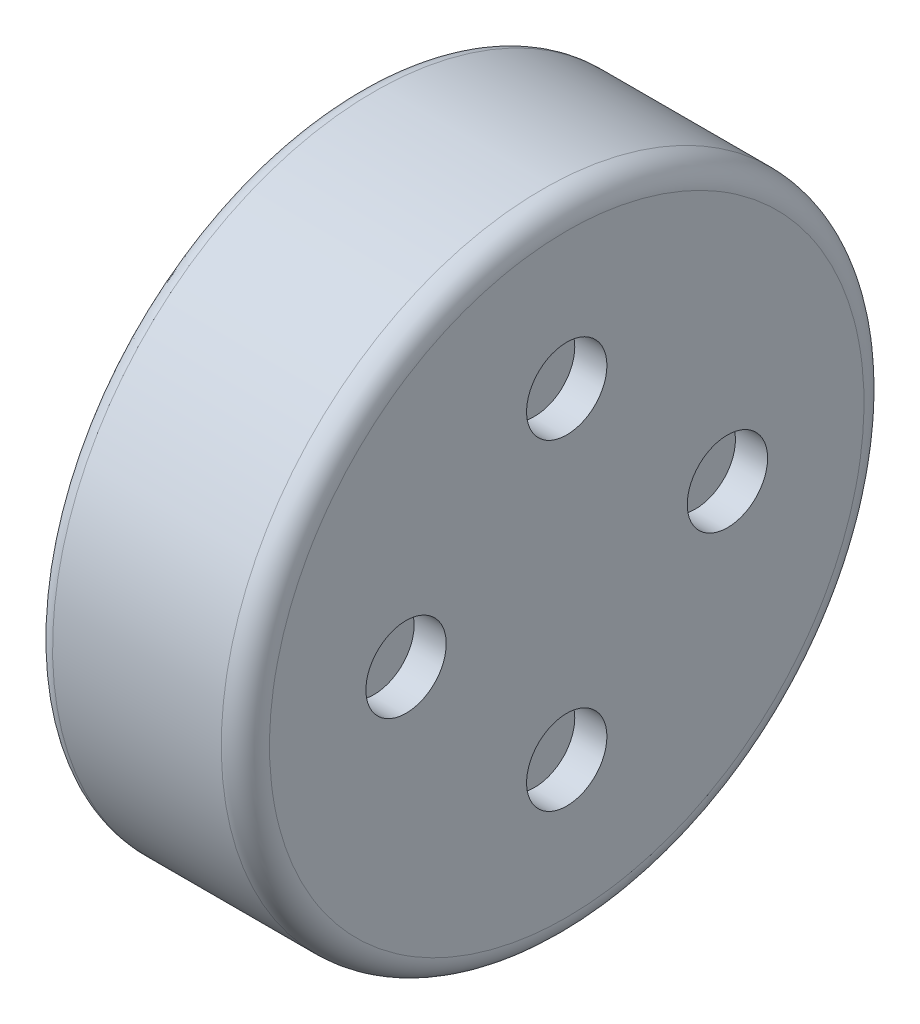
ISO-10303-21;
HEADER;
FILE_DESCRIPTION(('STEP AP214'),'2;1');
FILE_NAME('part.step','',(''),(''),'','','');
FILE_SCHEMA(('AUTOMOTIVE_DESIGN { 1 0 10303 214 1 1 1 1 }'));
ENDSEC;
DATA;
#1=APPLICATION_CONTEXT('core data for automotive mechanical design processes');
#2=APPLICATION_PROTOCOL_DEFINITION('international standard','automotive_design',2000,#1);
#3=PRODUCT_CONTEXT('',#1,'mechanical');
#4=PRODUCT('Part','Part','',(#3));
#5=PRODUCT_RELATED_PRODUCT_CATEGORY('part','',(#4));
#6=PRODUCT_DEFINITION_FORMATION('','',#4);
#7=PRODUCT_DEFINITION_CONTEXT('part definition',#1,'design');
#8=PRODUCT_DEFINITION('design','',#6,#7);
#9=PRODUCT_DEFINITION_SHAPE('','',#8);
#10=(LENGTH_UNIT() NAMED_UNIT(*) SI_UNIT(.MILLI.,.METRE.));
#11=(NAMED_UNIT(*) PLANE_ANGLE_UNIT() SI_UNIT($,.RADIAN.));
#12=(NAMED_UNIT(*) SI_UNIT($,.STERADIAN.) SOLID_ANGLE_UNIT());
#13=UNCERTAINTY_MEASURE_WITH_UNIT(LENGTH_MEASURE(1.E-05),#10,'distance_accuracy_value','');
#14=(GEOMETRIC_REPRESENTATION_CONTEXT(3) GLOBAL_UNCERTAINTY_ASSIGNED_CONTEXT((#13)) GLOBAL_UNIT_ASSIGNED_CONTEXT((#10,
#11,#12)) REPRESENTATION_CONTEXT('',''));
#15=CARTESIAN_POINT('',(0.,0.,0.));
#16=DIRECTION('',(0.,0.,1.));
#17=DIRECTION('',(1.,0.,0.));
#18=AXIS2_PLACEMENT_3D('',#15,#16,#17);
#19=CARTESIAN_POINT('',(0.,1.976,1.977361278997));
#20=DIRECTION('',(1.,0.,0.));
#21=DIRECTION('',(0.,-1.,0.));
#22=AXIS2_PLACEMENT_3D('',#19,#20,#21);
#23=PLANE('',#22);
#24=CARTESIAN_POINT('',(0.,0.,0.));
#25=DIRECTION('',(-1.,0.,0.));
#26=DIRECTION('',(0.,0.,1.));
#27=AXIS2_PLACEMENT_3D('',#24,#25,#26);
#28=CIRCLE('',#27,1.84999999999992);
#29=CARTESIAN_POINT('',(0.,0.,1.84999999999992));
#30=VERTEX_POINT('',#29);
#31=EDGE_CURVE('E12',#30,#30,#28,.T.);
#32=ORIENTED_EDGE('',*,*,#31,.F.);
#33=EDGE_LOOP('',(#32));
#34=FACE_BOUND('',#33,.T.);
#35=CARTESIAN_POINT('',(0.,0.,0.));
#36=DIRECTION('',(1.,0.,0.));
#37=DIRECTION('',(0.,0.,-1.));
#38=AXIS2_PLACEMENT_3D('',#35,#36,#37);
#39=CIRCLE('',#38,1.89999999999975);
#40=CARTESIAN_POINT('',(0.,0.,-1.89999999999978));
#41=VERTEX_POINT('',#40);
#42=EDGE_CURVE('E24',#41,#41,#39,.T.);
#43=ORIENTED_EDGE('',*,*,#42,.F.);
#44=EDGE_LOOP('',(#43));
#45=FACE_BOUND('',#44,.T.);
#46=ADVANCED_FACE('F20',(#34,#45),#23,.F.);
#47=CARTESIAN_POINT('',(0.0499999999999991,0.,0.));
#48=DIRECTION('',(-1.,0.,0.));
#49=DIRECTION('',(0.,0.,1.));
#50=AXIS2_PLACEMENT_3D('',#47,#48,#49);
#51=TOROIDAL_SURFACE('',#50,1.84999999999987,0.0499999999999997);
#52=ORIENTED_EDGE('',*,*,#31,.T.);
#53=EDGE_LOOP('',(#52));
#54=FACE_BOUND('',#53,.T.);
#55=CARTESIAN_POINT('',(0.0500000000000243,0.,0.));
#56=DIRECTION('',(-1.,0.,0.));
#57=DIRECTION('',(0.,0.999975195076289,-0.00704338215194111));
#58=AXIS2_PLACEMENT_3D('',#55,#56,#57);
#59=CIRCLE('',#58,1.79999999999987);
#60=CARTESIAN_POINT('',(0.0500000000000243,1.79995535113719,-0.0126780878734931));
#61=VERTEX_POINT('',#60);
#62=EDGE_CURVE('E105',#61,#61,#59,.T.);
#63=ORIENTED_EDGE('',*,*,#62,.F.);
#64=EDGE_LOOP('',(#63));
#65=FACE_BOUND('',#64,.T.);
#66=ADVANCED_FACE('F237',(#54,#65),#51,.T.);
#67=CARTESIAN_POINT('',(0.0999999999999999,0.,0.));
#68=DIRECTION('',(1.,0.,0.));
#69=DIRECTION('',(0.,0.,-1.));
#70=AXIS2_PLACEMENT_3D('',#67,#68,#69);
#71=TOROIDAL_SURFACE('',#70,1.89999999999958,0.0999999999999999);
#72=CARTESIAN_POINT('',(0.10000000000003,0.,0.));
#73=DIRECTION('',(1.,0.,0.));
#74=DIRECTION('',(0.,-0.999979907996012,-0.00633905389532759));
#75=AXIS2_PLACEMENT_3D('',#72,#73,#74);
#76=CIRCLE('',#75,1.99999999999958);
#77=CARTESIAN_POINT('',(0.10000000000003,-1.9999598159916,-0.0126781077906525));
#78=VERTEX_POINT('',#77);
#79=EDGE_CURVE('E110',#78,#78,#76,.T.);
#80=ORIENTED_EDGE('',*,*,#79,.F.);
#81=EDGE_LOOP('',(#80));
#82=FACE_BOUND('',#81,.T.);
#83=ORIENTED_EDGE('',*,*,#42,.T.);
#84=EDGE_LOOP('',(#83));
#85=FACE_BOUND('',#84,.T.);
#86=ADVANCED_FACE('F242',(#82,#85),#71,.T.);
#87=CARTESIAN_POINT('',(0.0499999999999999,0.,0.));
#88=DIRECTION('',(-1.,0.,0.));
#89=DIRECTION('',(0.,0.,1.));
#90=AXIS2_PLACEMENT_3D('',#87,#88,#89);
#91=CYLINDRICAL_SURFACE('',#90,1.8);
#92=CARTESIAN_POINT('',(0.0300000000000001,0.,0.));
#93=DIRECTION('',(-1.,0.,0.));
#94=DIRECTION('',(0.,0.,1.));
#95=AXIS2_PLACEMENT_3D('',#92,#93,#94);
#96=CIRCLE('',#95,1.8);
#97=CARTESIAN_POINT('',(0.0300000000000001,0.,1.8));
#98=VERTEX_POINT('',#97);
#99=EDGE_CURVE('E116',#98,#98,#96,.T.);
#100=ORIENTED_EDGE('',*,*,#99,.F.);
#101=EDGE_LOOP('',(#100));
#102=FACE_BOUND('',#101,.T.);
#103=ORIENTED_EDGE('',*,*,#62,.T.);
#104=EDGE_LOOP('',(#103));
#105=FACE_BOUND('',#104,.T.);
#106=ADVANCED_FACE('F248',(#102,#105),#91,.T.);
#107=CARTESIAN_POINT('',(0.100000000000001,0.,0.));
#108=DIRECTION('',(1.,0.,0.));
#109=DIRECTION('',(0.,0.,-1.));
#110=AXIS2_PLACEMENT_3D('',#107,#108,#109);
#111=CYLINDRICAL_SURFACE('',#110,2.);
#112=CARTESIAN_POINT('',(1.14999999999997,0.,0.));
#113=DIRECTION('',(1.,0.,0.));
#114=DIRECTION('',(0.,-1.,0.));
#115=AXIS2_PLACEMENT_3D('',#112,#113,#114);
#116=CIRCLE('',#115,2.);
#117=CARTESIAN_POINT('',(1.14999999999997,-2.,0.));
#118=VERTEX_POINT('',#117);
#119=EDGE_CURVE('E158',#118,#118,#116,.T.);
#120=ORIENTED_EDGE('',*,*,#119,.F.);
#121=EDGE_LOOP('',(#120));
#122=FACE_BOUND('',#121,.T.);
#123=ORIENTED_EDGE('',*,*,#79,.T.);
#124=EDGE_LOOP('',(#123));
#125=FACE_BOUND('',#124,.T.);
#126=ADVANCED_FACE('F251',(#122,#125),#111,.T.);
#127=CARTESIAN_POINT('',(0.03,1.872,-1.872));
#128=DIRECTION('',(-1.,0.,0.));
#129=DIRECTION('',(0.,-1.,0.));
#130=AXIS2_PLACEMENT_3D('',#127,#128,#129);
#131=PLANE('',#130);
#132=CARTESIAN_POINT('',(0.0300000000000007,-1.093714993739,-0.3553695435312));
#133=DIRECTION('',(1.,0.,0.));
#134=DIRECTION('',(0.,0.,1.));
#135=AXIS2_PLACEMENT_3D('',#132,#133,#134);
#136=CIRCLE('',#135,0.1999999999996);
#137=CARTESIAN_POINT('',(0.0300000000000007,-1.093714993739,-0.1553695435316));
#138=VERTEX_POINT('',#137);
#139=EDGE_CURVE('E115',#138,#138,#136,.T.);
#140=ORIENTED_EDGE('',*,*,#139,.T.);
#141=EDGE_LOOP('',(#140));
#142=FACE_BOUND('',#141,.T.);
#143=CARTESIAN_POINT('',(0.0300000000000007,-0.6759530401363,0.9303695435312));
#144=DIRECTION('',(1.,0.,0.));
#145=DIRECTION('',(0.,0.,1.));
#146=AXIS2_PLACEMENT_3D('',#143,#144,#145);
#147=CIRCLE('',#146,0.2);
#148=CARTESIAN_POINT('',(0.0300000000000007,-0.6759530401363,1.1303695435312));
#149=VERTEX_POINT('',#148);
#150=EDGE_CURVE('E793',#149,#149,#147,.T.);
#151=ORIENTED_EDGE('',*,*,#150,.T.);
#152=EDGE_LOOP('',(#151));
#153=FACE_BOUND('',#152,.T.);
#154=CARTESIAN_POINT('',(0.0300000000000007,0.6759530401363,0.9303695435312));
#155=DIRECTION('',(1.,0.,0.));
#156=DIRECTION('',(0.,0.,1.));
#157=AXIS2_PLACEMENT_3D('',#154,#155,#156);
#158=CIRCLE('',#157,0.2);
#159=CARTESIAN_POINT('',(0.0300000000000007,0.6759530401363,1.1303695435312));
#160=VERTEX_POINT('',#159);
#161=EDGE_CURVE('E797',#160,#160,#158,.T.);
#162=ORIENTED_EDGE('',*,*,#161,.T.);
#163=EDGE_LOOP('',(#162));
#164=FACE_BOUND('',#163,.T.);
#165=CARTESIAN_POINT('',(0.0300000000000007,1.093714993739,-0.3553695435312));
#166=DIRECTION('',(1.,0.,0.));
#167=DIRECTION('',(0.,0.,1.));
#168=AXIS2_PLACEMENT_3D('',#165,#166,#167);
#169=CIRCLE('',#168,0.2);
#170=CARTESIAN_POINT('',(0.0300000000000007,1.093714993739,-0.1553695435312));
#171=VERTEX_POINT('',#170);
#172=EDGE_CURVE('E801',#171,#171,#169,.T.);
#173=ORIENTED_EDGE('',*,*,#172,.T.);
#174=EDGE_LOOP('',(#173));
#175=FACE_BOUND('',#174,.T.);
#176=CARTESIAN_POINT('',(0.0300000000000007,0.,-1.15));
#177=DIRECTION('',(1.,0.,0.));
#178=DIRECTION('',(0.,0.,1.));
#179=AXIS2_PLACEMENT_3D('',#176,#177,#178);
#180=CIRCLE('',#179,0.2);
#181=CARTESIAN_POINT('',(0.0300000000000007,0.,-0.95));
#182=VERTEX_POINT('',#181);
#183=EDGE_CURVE('E805',#182,#182,#180,.T.);
#184=ORIENTED_EDGE('',*,*,#183,.T.);
#185=EDGE_LOOP('',(#184));
#186=FACE_BOUND('',#185,.T.);
#187=CARTESIAN_POINT('',(0.0300000000000012,0.,0.));
#188=DIRECTION('',(1.,0.,0.));
#189=DIRECTION('',(0.,0.,1.));
#190=AXIS2_PLACEMENT_3D('',#187,#188,#189);
#191=CIRCLE('',#190,0.9);
#192=CARTESIAN_POINT('',(0.0300000000000012,0.,0.9));
#193=VERTEX_POINT('',#192);
#194=EDGE_CURVE('E809',#193,#193,#191,.T.);
#195=ORIENTED_EDGE('',*,*,#194,.T.);
#196=EDGE_LOOP('',(#195));
#197=FACE_BOUND('',#196,.T.);
#198=ORIENTED_EDGE('',*,*,#99,.T.);
#199=EDGE_LOOP('',(#198));
#200=FACE_BOUND('',#199,.T.);
#201=ADVANCED_FACE('F255',(#142,#153,#164,#175,#186,#197,#200),#131,.T.);
#202=CARTESIAN_POINT('',(1.15,0.,0.));
#203=DIRECTION('',(1.,0.,0.));
#204=DIRECTION('',(0.,0.,-1.));
#205=AXIS2_PLACEMENT_3D('',#202,#203,#204);
#206=TOROIDAL_SURFACE('',#205,1.84999999999961,0.15);
#207=ORIENTED_EDGE('',*,*,#119,.T.);
#208=EDGE_LOOP('',(#207));
#209=FACE_BOUND('',#208,.T.);
#210=CARTESIAN_POINT('',(1.3,-1.84999999999977,3.95252000616812E-13));
#211=CARTESIAN_POINT('',(1.3,-1.84999999999962,-0.242574683896374));
#212=CARTESIAN_POINT('',(1.3,-1.80180116790839,-0.484161985174389));
#213=CARTESIAN_POINT('',(1.3,-1.61655310238297,-0.931766714575433));
#214=CARTESIAN_POINT('',(1.3,-1.4793664503779,-1.13682680389755));
#215=CARTESIAN_POINT('',(1.3,-1.13692864001234,-1.47946828649159));
#216=CARTESIAN_POINT('',(1.3,-0.931711601267875,-1.61642004708754));
#217=CARTESIAN_POINT('',(1.3,-0.484217098483389,-1.80193422320322));
#218=CARTESIAN_POINT('',(1.3,-0.242212106851741,-1.84992799099265));
#219=CARTESIAN_POINT('',(1.3,0.24221210685096,-1.85007200900659));
#220=CARTESIAN_POINT('',(1.3,0.484161985174186,-1.80180116790846));
#221=CARTESIAN_POINT('',(1.3,0.931766714575635,-1.61655310238291));
#222=CARTESIAN_POINT('',(1.3,1.13682680389726,-1.47936645037829));
#223=CARTESIAN_POINT('',(1.3,1.47946828649188,-1.13692864001196));
#224=CARTESIAN_POINT('',(1.3,1.61642004708769,-0.931711601267392));
#225=CARTESIAN_POINT('',(1.3,1.80193422320308,-0.484217098483871));
#226=CARTESIAN_POINT('',(1.3,1.84999999999962,-0.24331513264727));
#227=CARTESIAN_POINT('',(1.3,1.84999999999977,-2.34269662046164E-13));
#228=B_SPLINE_CURVE_WITH_KNOTS('',3,(#210,#211,#212,#213,#214,#215,#216,#217,#218,#219,#220,
#221,#222,#223,#224,#225,#226,#227),.UNSPECIFIED.,.F.,.F.,(4,2,2,2,2,2,2,2,4),(0.,0.125,0.25,
0.375,0.5,0.625,0.75,0.875,1.),.UNSPECIFIED.);
#229=CARTESIAN_POINT('',(1.3,-1.84999999999977,3.95252000616812E-13));
#230=VERTEX_POINT('',#229);
#231=CARTESIAN_POINT('',(1.3,1.84999999999977,-2.34269662046164E-13));
#232=VERTEX_POINT('',#231);
#233=EDGE_CURVE('E38',#230,#232,#228,.T.);
#234=ORIENTED_EDGE('',*,*,#233,.F.);
#235=CARTESIAN_POINT('',(1.3,1.84999999999977,-2.34269662046164E-13));
#236=CARTESIAN_POINT('',(1.3,1.84999999999962,0.242574683896181));
#237=CARTESIAN_POINT('',(1.3,1.80180116790838,0.484161985174327));
#238=CARTESIAN_POINT('',(1.3,1.61655310238302,0.931766714575401));
#239=CARTESIAN_POINT('',(1.3,1.47936645037807,1.13682680389738));
#240=CARTESIAN_POINT('',(1.3,1.13692864001232,1.47946828649161));
#241=CARTESIAN_POINT('',(1.3,0.931711601268343,1.61642004708741));
#242=CARTESIAN_POINT('',(1.3,0.4842170984832,1.80193422320324));
#243=CARTESIAN_POINT('',(1.3,0.242212106851824,1.8499279909927));
#244=CARTESIAN_POINT('',(1.3,-0.24221210685064,1.85007200900654));
#245=CARTESIAN_POINT('',(1.3,-0.484161985175012,1.8018011679081));
#246=CARTESIAN_POINT('',(1.3,-0.931766714574344,1.61655310238345));
#247=CARTESIAN_POINT('',(1.3,-1.13682680389705,1.47936645037849));
#248=CARTESIAN_POINT('',(1.3,-1.47946828649166,1.13692864001218));
#249=CARTESIAN_POINT('',(1.3,-1.61642004708728,0.931711601268595));
#250=CARTESIAN_POINT('',(1.3,-1.80193422320321,0.48421709848332));
#251=CARTESIAN_POINT('',(1.3,-1.84999999999962,0.243315132647136));
#252=CARTESIAN_POINT('',(1.3,-1.84999999999977,3.95252000616812E-13));
#253=B_SPLINE_CURVE_WITH_KNOTS('',3,(#235,#236,#237,#238,#239,#240,#241,#242,#243,#244,#245,
#246,#247,#248,#249,#250,#251,#252),.UNSPECIFIED.,.F.,.F.,(4,2,2,2,2,2,2,2,4),(0.,0.125,0.25,
0.375,0.5,0.625,0.75,0.875,1.),.UNSPECIFIED.);
#254=EDGE_CURVE('E129',#232,#230,#253,.T.);
#255=ORIENTED_EDGE('',*,*,#254,.F.);
#256=EDGE_LOOP('',(#234,#255));
#257=FACE_BOUND('',#256,.T.);
#258=ADVANCED_FACE('F259',(#209,#257),#206,.T.);
#259=CARTESIAN_POINT('',(0.0300000000000007,-1.093714993739,-0.3553695435312));
#260=DIRECTION('',(-1.,0.,0.));
#261=DIRECTION('',(0.,0.,1.));
#262=AXIS2_PLACEMENT_3D('',#259,#260,#261);
#263=CYLINDRICAL_SURFACE('',#262,0.1999999999996);
#264=ORIENTED_EDGE('',*,*,#139,.F.);
#265=EDGE_LOOP('',(#264));
#266=FACE_BOUND('',#265,.T.);
#267=CARTESIAN_POINT('',(0.0199999999999993,-1.093714993739,-0.3553695435312));
#268=DIRECTION('',(-1.,0.,0.));
#269=DIRECTION('',(0.,1.,0.));
#270=AXIS2_PLACEMENT_3D('',#267,#268,#269);
#271=CIRCLE('',#270,0.1999999999996);
#272=CARTESIAN_POINT('',(0.0199999999999993,-0.8937149937394,-0.3553695435312));
#273=VERTEX_POINT('',#272);
#274=EDGE_CURVE('E123',#273,#273,#271,.T.);
#275=ORIENTED_EDGE('',*,*,#274,.F.);
#276=EDGE_LOOP('',(#275));
#277=FACE_BOUND('',#276,.T.);
#278=ADVANCED_FACE('F261',(#266,#277),#263,.T.);
#279=CARTESIAN_POINT('',(0.0300000000000007,-0.6759530401363,0.9303695435312));
#280=DIRECTION('',(-1.,0.,0.));
#281=DIRECTION('',(0.,0.,1.));
#282=AXIS2_PLACEMENT_3D('',#279,#280,#281);
#283=CYLINDRICAL_SURFACE('',#282,0.2);
#284=ORIENTED_EDGE('',*,*,#150,.F.);
#285=EDGE_LOOP('',(#284));
#286=FACE_BOUND('',#285,.T.);
#287=CARTESIAN_POINT('',(0.0199999999999993,-0.6759530401363,0.9303695435312));
#288=DIRECTION('',(-1.,0.,0.));
#289=DIRECTION('',(0.,1.,0.));
#290=AXIS2_PLACEMENT_3D('',#287,#288,#289);
#291=CIRCLE('',#290,0.2);
#292=CARTESIAN_POINT('',(0.0199999999999993,-0.4759530401363,0.9303695435312));
#293=VERTEX_POINT('',#292);
#294=EDGE_CURVE('E128',#293,#293,#291,.T.);
#295=ORIENTED_EDGE('',*,*,#294,.F.);
#296=EDGE_LOOP('',(#295));
#297=FACE_BOUND('',#296,.T.);
#298=ADVANCED_FACE('F264',(#286,#297),#283,.T.);
#299=CARTESIAN_POINT('',(0.0300000000000007,0.6759530401363,0.9303695435312));
#300=DIRECTION('',(-1.,0.,0.));
#301=DIRECTION('',(0.,0.,1.));
#302=AXIS2_PLACEMENT_3D('',#299,#300,#301);
#303=CYLINDRICAL_SURFACE('',#302,0.2);
#304=ORIENTED_EDGE('',*,*,#161,.F.);
#305=EDGE_LOOP('',(#304));
#306=FACE_BOUND('',#305,.T.);
#307=CARTESIAN_POINT('',(0.0199999999999993,0.6759530401363,0.9303695435312));
#308=DIRECTION('',(-1.,0.,0.));
#309=DIRECTION('',(0.,1.,0.));
#310=AXIS2_PLACEMENT_3D('',#307,#308,#309);
#311=CIRCLE('',#310,0.2);
#312=CARTESIAN_POINT('',(0.0199999999999993,0.8759530401363,0.9303695435312));
#313=VERTEX_POINT('',#312);
#314=EDGE_CURVE('E138',#313,#313,#311,.T.);
#315=ORIENTED_EDGE('',*,*,#314,.F.);
#316=EDGE_LOOP('',(#315));
#317=FACE_BOUND('',#316,.T.);
#318=ADVANCED_FACE('F268',(#306,#317),#303,.T.);
#319=CARTESIAN_POINT('',(0.0300000000000007,1.093714993739,-0.3553695435312));
#320=DIRECTION('',(-1.,0.,0.));
#321=DIRECTION('',(0.,0.,1.));
#322=AXIS2_PLACEMENT_3D('',#319,#320,#321);
#323=CYLINDRICAL_SURFACE('',#322,0.2);
#324=ORIENTED_EDGE('',*,*,#172,.F.);
#325=EDGE_LOOP('',(#324));
#326=FACE_BOUND('',#325,.T.);
#327=CARTESIAN_POINT('',(0.0199999999999993,1.093714993739,-0.3553695435312));
#328=DIRECTION('',(-1.,0.,0.));
#329=DIRECTION('',(0.,1.,0.));
#330=AXIS2_PLACEMENT_3D('',#327,#328,#329);
#331=CIRCLE('',#330,0.2);
#332=CARTESIAN_POINT('',(0.0199999999999993,1.293714993739,-0.3553695435312));
#333=VERTEX_POINT('',#332);
#334=EDGE_CURVE('E143',#333,#333,#331,.T.);
#335=ORIENTED_EDGE('',*,*,#334,.F.);
#336=EDGE_LOOP('',(#335));
#337=FACE_BOUND('',#336,.T.);
#338=ADVANCED_FACE('F272',(#326,#337),#323,.T.);
#339=CARTESIAN_POINT('',(0.0300000000000007,0.,-1.15));
#340=DIRECTION('',(-1.,0.,0.));
#341=DIRECTION('',(0.,0.,1.));
#342=AXIS2_PLACEMENT_3D('',#339,#340,#341);
#343=CYLINDRICAL_SURFACE('',#342,0.2);
#344=ORIENTED_EDGE('',*,*,#183,.F.);
#345=EDGE_LOOP('',(#344));
#346=FACE_BOUND('',#345,.T.);
#347=CARTESIAN_POINT('',(0.0199999999999993,0.,-1.15));
#348=DIRECTION('',(-1.,0.,0.));
#349=DIRECTION('',(0.,1.,0.));
#350=AXIS2_PLACEMENT_3D('',#347,#348,#349);
#351=CIRCLE('',#350,0.2);
#352=CARTESIAN_POINT('',(0.0199999999999993,0.2,-1.15));
#353=VERTEX_POINT('',#352);
#354=EDGE_CURVE('E147',#353,#353,#351,.T.);
#355=ORIENTED_EDGE('',*,*,#354,.F.);
#356=EDGE_LOOP('',(#355));
#357=FACE_BOUND('',#356,.T.);
#358=ADVANCED_FACE('F276',(#346,#357),#343,.T.);
#359=CARTESIAN_POINT('',(0.0799999999999988,0.,0.));
#360=DIRECTION('',(-1.,0.,0.));
#361=DIRECTION('',(0.,0.,1.));
#362=AXIS2_PLACEMENT_3D('',#359,#360,#361);
#363=CYLINDRICAL_SURFACE('',#362,0.9);
#364=ORIENTED_EDGE('',*,*,#194,.F.);
#365=EDGE_LOOP('',(#364));
#366=FACE_BOUND('',#365,.T.);
#367=CARTESIAN_POINT('',(0.0799999999999988,0.,0.));
#368=DIRECTION('',(1.,0.,0.));
#369=DIRECTION('',(0.,0.,1.));
#370=AXIS2_PLACEMENT_3D('',#367,#368,#369);
#371=CIRCLE('',#370,0.9);
#372=CARTESIAN_POINT('',(0.0799999999999988,0.,0.9));
#373=VERTEX_POINT('',#372);
#374=EDGE_CURVE('E153',#373,#373,#371,.T.);
#375=ORIENTED_EDGE('',*,*,#374,.T.);
#376=EDGE_LOOP('',(#375));
#377=FACE_BOUND('',#376,.T.);
#378=ADVANCED_FACE('F280',(#366,#377),#363,.F.);
#379=CARTESIAN_POINT('',(1.3,1.924,1.925325451786));
#380=DIRECTION('',(1.,0.,0.));
#381=DIRECTION('',(0.,-1.,0.));
#382=AXIS2_PLACEMENT_3D('',#379,#380,#381);
#383=PLANE('',#382);
#384=CARTESIAN_POINT('',(1.29999999999993,0.,1.));
#385=DIRECTION('',(-1.,0.,0.));
#386=DIRECTION('',(0.,0.,-1.));
#387=AXIS2_PLACEMENT_3D('',#384,#385,#386);
#388=CIRCLE('',#387,0.25);
#389=CARTESIAN_POINT('',(1.29999999999993,0.,0.75));
#390=VERTEX_POINT('',#389);
#391=EDGE_CURVE('E159',#390,#390,#388,.T.);
#392=ORIENTED_EDGE('',*,*,#391,.T.);
#393=EDGE_LOOP('',(#392));
#394=FACE_BOUND('',#393,.T.);
#395=CARTESIAN_POINT('',(1.29999999999993,-1.,0.));
#396=DIRECTION('',(-1.,0.,0.));
#397=DIRECTION('',(0.,0.,-1.));
#398=AXIS2_PLACEMENT_3D('',#395,#396,#397);
#399=CIRCLE('',#398,0.25);
#400=CARTESIAN_POINT('',(1.29999999999993,-1.,-0.25));
#401=VERTEX_POINT('',#400);
#402=EDGE_CURVE('E361',#401,#401,#399,.T.);
#403=ORIENTED_EDGE('',*,*,#402,.T.);
#404=EDGE_LOOP('',(#403));
#405=FACE_BOUND('',#404,.T.);
#406=CARTESIAN_POINT('',(1.29999999999993,0.,-1.));
#407=DIRECTION('',(-1.,0.,0.));
#408=DIRECTION('',(0.,0.,-1.));
#409=AXIS2_PLACEMENT_3D('',#406,#407,#408);
#410=CIRCLE('',#409,0.25);
#411=CARTESIAN_POINT('',(1.29999999999993,0.,-1.25));
#412=VERTEX_POINT('',#411);
#413=EDGE_CURVE('E357',#412,#412,#410,.T.);
#414=ORIENTED_EDGE('',*,*,#413,.T.);
#415=EDGE_LOOP('',(#414));
#416=FACE_BOUND('',#415,.T.);
#417=CARTESIAN_POINT('',(1.29999999999993,1.,0.));
#418=DIRECTION('',(-1.,0.,0.));
#419=DIRECTION('',(0.,0.,-1.));
#420=AXIS2_PLACEMENT_3D('',#417,#418,#419);
#421=CIRCLE('',#420,0.25);
#422=CARTESIAN_POINT('',(1.29999999999993,1.,-0.25));
#423=VERTEX_POINT('',#422);
#424=EDGE_CURVE('E354',#423,#423,#421,.T.);
#425=ORIENTED_EDGE('',*,*,#424,.T.);
#426=EDGE_LOOP('',(#425));
#427=FACE_BOUND('',#426,.T.);
#428=ORIENTED_EDGE('',*,*,#254,.T.);
#429=ORIENTED_EDGE('',*,*,#233,.T.);
#430=EDGE_LOOP('',(#428,#429));
#431=FACE_BOUND('',#430,.T.);
#432=ADVANCED_FACE('F284',(#394,#405,#416,#427,#431),#383,.T.);
#433=CARTESIAN_POINT('',(0.0199999999999997,-1.093714993739,-0.3553695435312));
#434=DIRECTION('',(-1.,0.,0.));
#435=DIRECTION('',(0.,0.,1.));
#436=AXIS2_PLACEMENT_3D('',#433,#434,#435);
#437=TOROIDAL_SURFACE('',#436,0.130000000000402,0.0699999999999999);
#438=ORIENTED_EDGE('',*,*,#274,.T.);
#439=EDGE_LOOP('',(#438));
#440=FACE_BOUND('',#439,.T.);
#441=CARTESIAN_POINT('',(-0.05,-0.963714993739072,-0.355369543497268));
#442=CARTESIAN_POINT('',(-0.05,-0.963714993695452,-0.389023166729015));
#443=CARTESIAN_POINT('',(-0.05,-0.978719118616594,-0.42380453563286));
#444=CARTESIAN_POINT('',(-0.05,-1.02486310551346,-0.470782314297509));
#445=CARTESIAN_POINT('',(-0.05,-1.06079147761698,-0.485074753624274));
#446=CARTESIAN_POINT('',(-0.05,-1.12663850952164,-0.485664333437356));
#447=CARTESIAN_POINT('',(-0.05,-1.16214998584067,-0.470365418653606));
#448=CARTESIAN_POINT('',(-0.05,-1.20912776450533,-0.424221431756716));
#449=CARTESIAN_POINT('',(-0.05,-1.22371499369259,-0.390637315716621));
#450=CARTESIAN_POINT('',(-0.05,-1.22371499373909,-0.355369543633003));
#451=B_SPLINE_CURVE_WITH_KNOTS('',3,(#441,#442,#443,#444,#445,#446,#447,#448,#449,#450),
.UNSPECIFIED.,.F.,.F.,(4,2,2,2,4),(0.,0.25,0.5,0.75,1.),.UNSPECIFIED.);
#452=CARTESIAN_POINT('',(-0.05,-0.963714993739072,-0.355369543497268));
#453=VERTEX_POINT('',#452);
#454=CARTESIAN_POINT('',(-0.05,-1.22371499373909,-0.355369543633003));
#455=VERTEX_POINT('',#454);
#456=EDGE_CURVE('E206',#453,#455,#451,.T.);
#457=ORIENTED_EDGE('',*,*,#456,.F.);
#458=CARTESIAN_POINT('',(-0.05,-1.22371499373909,-0.355369543633003));
#459=CARTESIAN_POINT('',(-0.05,-1.22371499378334,-0.321715920318808));
#460=CARTESIAN_POINT('',(-0.05,-1.20871086884954,-0.286934551401686));
#461=CARTESIAN_POINT('',(-0.05,-1.1625668819175,-0.23995677273158));
#462=CARTESIAN_POINT('',(-0.05,-1.12663850979059,-0.225664333416085));
#463=CARTESIAN_POINT('',(-0.05,-1.06079147785706,-0.225074753645485));
#464=CARTESIAN_POINT('',(-0.05,-1.02528000153443,-0.240373668465325));
#465=CARTESIAN_POINT('',(-0.05,-0.978302222894442,-0.286517655428024));
#466=CARTESIAN_POINT('',(-0.05,-0.963714993738585,-0.320101771500186));
#467=CARTESIAN_POINT('',(-0.05,-0.963714993739072,-0.355369543497268));
#468=B_SPLINE_CURVE_WITH_KNOTS('',3,(#458,#459,#460,#461,#462,#463,#464,#465,#466,#467),
.UNSPECIFIED.,.F.,.F.,(4,2,2,2,4),(0.,0.25,0.5,0.75,1.),.UNSPECIFIED.);
#469=EDGE_CURVE('E370',#455,#453,#468,.T.);
#470=ORIENTED_EDGE('',*,*,#469,.F.);
#471=EDGE_LOOP('',(#457,#470));
#472=FACE_BOUND('',#471,.T.);
#473=ADVANCED_FACE('F288',(#440,#472),#437,.T.);
#474=CARTESIAN_POINT('',(0.02,-0.6759530401363,0.9303695435312));
#475=DIRECTION('',(-1.,0.,0.));
#476=DIRECTION('',(0.,0.,1.));
#477=AXIS2_PLACEMENT_3D('',#474,#475,#476);
#478=TOROIDAL_SURFACE('',#477,0.130000000000002,0.07);
#479=ORIENTED_EDGE('',*,*,#294,.T.);
#480=EDGE_LOOP('',(#479));
#481=FACE_BOUND('',#480,.T.);
#482=CARTESIAN_POINT('',(-0.05,-0.545953040136292,0.930369543565135));
#483=CARTESIAN_POINT('',(-0.05,-0.545953040092357,0.896715920333267));
#484=CARTESIAN_POINT('',(-0.05,-0.560957165013538,0.861934551429325));
#485=CARTESIAN_POINT('',(-0.05,-0.607101151910562,0.814956772764528));
#486=CARTESIAN_POINT('',(-0.05,-0.643029524014198,0.800664333437729));
#487=CARTESIAN_POINT('',(-0.05,-0.708876555919024,0.800074753624641));
#488=CARTESIAN_POINT('',(-0.05,-0.744388032238173,0.815373668408436));
#489=CARTESIAN_POINT('',(-0.05,-0.791365810902975,0.861517655305466));
#490=CARTESIAN_POINT('',(-0.05,-0.80595304009028,0.895101771345656));
#491=CARTESIAN_POINT('',(-0.05,-0.805953040136308,0.930369543429387));
#492=B_SPLINE_CURVE_WITH_KNOTS('',3,(#482,#483,#484,#485,#486,#487,#488,#489,#490,#491),
.UNSPECIFIED.,.F.,.F.,(4,2,2,2,4),(0.,0.25,0.5,0.75,1.),.UNSPECIFIED.);
#493=CARTESIAN_POINT('',(-0.05,-0.545953040136292,0.930369543565135));
#494=VERTEX_POINT('',#493);
#495=CARTESIAN_POINT('',(-0.05,-0.805953040136308,0.930369543429387));
#496=VERTEX_POINT('',#495);
#497=EDGE_CURVE('E380',#494,#496,#492,.T.);
#498=ORIENTED_EDGE('',*,*,#497,.F.);
#499=CARTESIAN_POINT('',(-0.05,-0.805953040136308,0.930369543429387));
#500=CARTESIAN_POINT('',(-0.05,-0.805953040180243,0.964023166743465));
#501=CARTESIAN_POINT('',(-0.05,-0.790948915246486,0.998804535660495));
#502=CARTESIAN_POINT('',(-0.05,-0.744804928314618,1.04578231433045));
#503=CARTESIAN_POINT('',(-0.05,-0.708876556187804,1.06007475364591));
#504=CARTESIAN_POINT('',(-0.05,-0.643029524254479,1.06066433341652));
#505=CARTESIAN_POINT('',(-0.05,-0.607518047931956,1.04536541859673));
#506=CARTESIAN_POINT('',(-0.05,-0.560540269292108,0.999221431634185));
#507=CARTESIAN_POINT('',(-0.05,-0.545953040136285,0.96563731556211));
#508=CARTESIAN_POINT('',(-0.05,-0.545953040136292,0.930369543565135));
#509=B_SPLINE_CURVE_WITH_KNOTS('',3,(#499,#500,#501,#502,#503,#504,#505,#506,#507,#508),
.UNSPECIFIED.,.F.,.F.,(4,2,2,2,4),(0.,0.25,0.5,0.75,1.),.UNSPECIFIED.);
#510=EDGE_CURVE('E393',#496,#494,#509,.T.);
#511=ORIENTED_EDGE('',*,*,#510,.F.);
#512=EDGE_LOOP('',(#498,#511));
#513=FACE_BOUND('',#512,.T.);
#514=ADVANCED_FACE('F460',(#481,#513),#478,.T.);
#515=CARTESIAN_POINT('',(0.0199999999999998,0.6759530401363,0.9303695435312));
#516=DIRECTION('',(-1.,0.,0.));
#517=DIRECTION('',(0.,0.,1.));
#518=AXIS2_PLACEMENT_3D('',#515,#516,#517);
#519=TOROIDAL_SURFACE('',#518,0.130000000000002,0.0699999999999999);
#520=ORIENTED_EDGE('',*,*,#314,.T.);
#521=EDGE_LOOP('',(#520));
#522=FACE_BOUND('',#521,.T.);
#523=CARTESIAN_POINT('',(-0.05,0.805953040136308,0.930369543565135));
#524=CARTESIAN_POINT('',(-0.05,0.805953040180243,0.896715920333269));
#525=CARTESIAN_POINT('',(-0.05,0.79094891525906,0.861934551429323));
#526=CARTESIAN_POINT('',(-0.05,0.744804928362041,0.814956772764529));
#527=CARTESIAN_POINT('',(-0.05,0.708876556258403,0.800664333437729));
#528=CARTESIAN_POINT('',(-0.05,0.643029524353574,0.800074753624641));
#529=CARTESIAN_POINT('',(-0.05,0.607518048034421,0.815373668408437));
#530=CARTESIAN_POINT('',(-0.05,0.560540269369631,0.861517655305464));
#531=CARTESIAN_POINT('',(-0.05,0.54595304018232,0.895101771345644));
#532=CARTESIAN_POINT('',(-0.05,0.545953040136292,0.930369543429387));
#533=B_SPLINE_CURVE_WITH_KNOTS('',3,(#523,#524,#525,#526,#527,#528,#529,#530,#531,#532),
.UNSPECIFIED.,.F.,.F.,(4,2,2,2,4),(0.,0.25,0.5,0.75,1.),.UNSPECIFIED.);
#534=CARTESIAN_POINT('',(-0.05,0.805953040136308,0.930369543565135));
#535=VERTEX_POINT('',#534);
#536=CARTESIAN_POINT('',(-0.05,0.545953040136292,0.930369543429387));
#537=VERTEX_POINT('',#536);
#538=EDGE_CURVE('E399',#535,#537,#533,.T.);
#539=ORIENTED_EDGE('',*,*,#538,.F.);
#540=CARTESIAN_POINT('',(-0.05,0.545953040136292,0.930369543429387));
#541=CARTESIAN_POINT('',(-0.05,0.545953040092357,0.964023166743468));
#542=CARTESIAN_POINT('',(-0.05,0.560957165026098,0.998804535660484));
#543=CARTESIAN_POINT('',(-0.05,0.607101151957998,1.04578231433046));
#544=CARTESIAN_POINT('',(-0.05,0.643029524084803,1.06007475364591));
#545=CARTESIAN_POINT('',(-0.05,0.708876556018114,1.06066433341652));
#546=CARTESIAN_POINT('',(-0.05,0.744388032340636,1.04536541859674));
#547=CARTESIAN_POINT('',(-0.05,0.791365810980501,0.999221431634174));
#548=CARTESIAN_POINT('',(-0.05,0.805953040136315,0.965637315562103));
#549=CARTESIAN_POINT('',(-0.05,0.805953040136308,0.930369543565135));
#550=B_SPLINE_CURVE_WITH_KNOTS('',3,(#540,#541,#542,#543,#544,#545,#546,#547,#548,#549),
.UNSPECIFIED.,.F.,.F.,(4,2,2,2,4),(0.,0.25,0.5,0.75,1.),.UNSPECIFIED.);
#551=EDGE_CURVE('E408',#537,#535,#550,.T.);
#552=ORIENTED_EDGE('',*,*,#551,.F.);
#553=EDGE_LOOP('',(#539,#552));
#554=FACE_BOUND('',#553,.T.);
#555=ADVANCED_FACE('F454',(#522,#554),#519,.T.);
#556=CARTESIAN_POINT('',(0.02,1.093714993739,-0.3553695435312));
#557=DIRECTION('',(-1.,0.,0.));
#558=DIRECTION('',(0.,0.,1.));
#559=AXIS2_PLACEMENT_3D('',#556,#557,#558);
#560=TOROIDAL_SURFACE('',#559,0.129999999999602,0.07);
#561=ORIENTED_EDGE('',*,*,#334,.T.);
#562=EDGE_LOOP('',(#561));
#563=FACE_BOUND('',#562,.T.);
#564=CARTESIAN_POINT('',(-0.05,1.22371499373893,-0.355369543497261));
#565=CARTESIAN_POINT('',(-0.05,1.22371499378334,-0.389023166729245));
#566=CARTESIAN_POINT('',(-0.05,1.20871086886211,-0.423804535633294));
#567=CARTESIAN_POINT('',(-0.05,1.16256688196494,-0.470782314298232));
#568=CARTESIAN_POINT('',(-0.05,1.1266385098612,-0.485074753625071));
#569=CARTESIAN_POINT('',(-0.05,1.06079147795617,-0.485664333438159));
#570=CARTESIAN_POINT('',(-0.05,1.02528000163692,-0.470365418654324));
#571=CARTESIAN_POINT('',(-0.05,0.978302222971976,-0.424221431757154));
#572=CARTESIAN_POINT('',(-0.05,0.963714993784625,-0.390637315716867));
#573=CARTESIAN_POINT('',(-0.05,0.963714993739232,-0.355369543633024));
#574=B_SPLINE_CURVE_WITH_KNOTS('',3,(#564,#565,#566,#567,#568,#569,#570,#571,#572,#573),
.UNSPECIFIED.,.F.,.F.,(4,2,2,2,4),(0.,0.25,0.5,0.75,1.),.UNSPECIFIED.);
#575=CARTESIAN_POINT('',(-0.05,1.22371499373893,-0.355369543497261));
#576=VERTEX_POINT('',#575);
#577=CARTESIAN_POINT('',(-0.05,0.963714993739232,-0.355369543633024));
#578=VERTEX_POINT('',#577);
#579=EDGE_CURVE('E418',#576,#578,#574,.T.);
#580=ORIENTED_EDGE('',*,*,#579,.F.);
#581=CARTESIAN_POINT('',(-0.05,0.963714993739232,-0.355369543633024));
#582=CARTESIAN_POINT('',(-0.05,0.963714993695453,-0.321715920319036));
#583=CARTESIAN_POINT('',(-0.05,0.97871911862916,-0.286934551402131));
#584=CARTESIAN_POINT('',(-0.05,1.02486310556088,-0.239956772732316));
#585=CARTESIAN_POINT('',(-0.05,1.06079147768759,-0.225664333416894));
#586=CARTESIAN_POINT('',(-0.05,1.12663850962069,-0.225074753646276));
#587=CARTESIAN_POINT('',(-0.05,1.16214998594312,-0.240373668466012));
#588=CARTESIAN_POINT('',(-0.05,1.20912776458283,-0.286517655428417));
#589=CARTESIAN_POINT('',(-0.05,1.22371499373862,-0.320101771500388));
#590=CARTESIAN_POINT('',(-0.05,1.22371499373893,-0.355369543497261));
#591=B_SPLINE_CURVE_WITH_KNOTS('',3,(#581,#582,#583,#584,#585,#586,#587,#588,#589,#590),
.UNSPECIFIED.,.F.,.F.,(4,2,2,2,4),(0.,0.25,0.5,0.75,1.),.UNSPECIFIED.);
#592=EDGE_CURVE('E428',#578,#576,#591,.T.);
#593=ORIENTED_EDGE('',*,*,#592,.F.);
#594=EDGE_LOOP('',(#580,#593));
#595=FACE_BOUND('',#594,.T.);
#596=ADVANCED_FACE('F450',(#563,#595),#560,.T.);
#597=CARTESIAN_POINT('',(0.02,0.,-1.15));
#598=DIRECTION('',(-1.,0.,0.));
#599=DIRECTION('',(0.,0.,1.));
#600=AXIS2_PLACEMENT_3D('',#597,#598,#599);
#601=TOROIDAL_SURFACE('',#600,0.13000000000002,0.07);
#602=ORIENTED_EDGE('',*,*,#354,.T.);
#603=EDGE_LOOP('',(#602));
#604=FACE_BOUND('',#603,.T.);
#605=CARTESIAN_POINT('',(-0.05,0.130000000000018,-1.14999999996583));
#606=CARTESIAN_POINT('',(-0.05,0.130000000044064,-1.18365362319754));
#607=CARTESIAN_POINT('',(-0.05,0.114995875122975,-1.21843499210154));
#608=CARTESIAN_POINT('',(-0.05,0.0688518882261152,-1.26541277076647));
#609=CARTESIAN_POINT('',(-0.05,0.0329235161224951,-1.27970521009338));
#610=CARTESIAN_POINT('',(-0.05,-0.0329235157823184,-1.28029478990668));
#611=CARTESIAN_POINT('',(-0.05,-0.0684349921015355,-1.26499587512298));
#612=CARTESIAN_POINT('',(-0.05,-0.115412770766472,-1.21885188822611));
#613=CARTESIAN_POINT('',(-0.05,-0.12999999995389,-1.18526777218596));
#614=CARTESIAN_POINT('',(-0.05,-0.130000000000018,-1.15000000010205));
#615=B_SPLINE_CURVE_WITH_KNOTS('',3,(#605,#606,#607,#608,#609,#610,#611,#612,#613,#614),
.UNSPECIFIED.,.F.,.F.,(4,2,2,2,4),(0.,0.25,0.5,0.75,1.),.UNSPECIFIED.);
#616=CARTESIAN_POINT('',(-0.05,0.130000000000018,-1.14999999996583));
#617=VERTEX_POINT('',#616);
#618=CARTESIAN_POINT('',(-0.05,-0.130000000000018,-1.15000000010205));
#619=VERTEX_POINT('',#618);
#620=EDGE_CURVE('E434',#617,#619,#615,.T.);
#621=ORIENTED_EDGE('',*,*,#620,.F.);
#622=CARTESIAN_POINT('',(-0.05,-0.130000000000018,-1.15000000010205));
#623=CARTESIAN_POINT('',(-0.05,-0.130000000044064,-1.11634637678813));
#624=CARTESIAN_POINT('',(-0.05,-0.114995875110422,-1.08156500787106));
#625=CARTESIAN_POINT('',(-0.05,-0.0688518881786719,-1.03458722920094));
#626=CARTESIAN_POINT('',(-0.05,-0.0329235160519151,-1.02029478988537));
#627=CARTESIAN_POINT('',(-0.05,0.0329235158814334,-1.01970521011456));
#628=CARTESIAN_POINT('',(-0.05,0.0684349922039904,-1.03500412493423));
#629=CARTESIAN_POINT('',(-0.05,0.115412770844006,-1.08114811189667));
#630=CARTESIAN_POINT('',(-0.05,0.130000000000033,-1.11473222796894));
#631=CARTESIAN_POINT('',(-0.05,0.130000000000018,-1.14999999996583));
#632=B_SPLINE_CURVE_WITH_KNOTS('',3,(#622,#623,#624,#625,#626,#627,#628,#629,#630,#631),
.UNSPECIFIED.,.F.,.F.,(4,2,2,2,4),(0.,0.25,0.5,0.75,1.),.UNSPECIFIED.);
#633=EDGE_CURVE('E177',#619,#617,#632,.T.);
#634=ORIENTED_EDGE('',*,*,#633,.F.);
#635=EDGE_LOOP('',(#621,#634));
#636=FACE_BOUND('',#635,.T.);
#637=ADVANCED_FACE('F294',(#604,#636),#601,.T.);
#638=CARTESIAN_POINT('',(0.08,0.936,-0.9369378063912));
#639=DIRECTION('',(-1.,0.,0.));
#640=DIRECTION('',(0.,-1.,0.));
#641=AXIS2_PLACEMENT_3D('',#638,#639,#640);
#642=PLANE('',#641);
#643=CARTESIAN_POINT('',(0.0799999999999988,0.,0.));
#644=DIRECTION('',(1.,0.,0.));
#645=DIRECTION('',(0.,0.,1.));
#646=AXIS2_PLACEMENT_3D('',#643,#644,#645);
#647=CIRCLE('',#646,0.6);
#648=CARTESIAN_POINT('',(0.0799999999999988,0.,0.6));
#649=VERTEX_POINT('',#648);
#650=EDGE_CURVE('E152',#649,#649,#647,.T.);
#651=ORIENTED_EDGE('',*,*,#650,.T.);
#652=EDGE_LOOP('',(#651));
#653=FACE_BOUND('',#652,.T.);
#654=ORIENTED_EDGE('',*,*,#374,.F.);
#655=EDGE_LOOP('',(#654));
#656=FACE_BOUND('',#655,.T.);
#657=ADVANCED_FACE('F290',(#653,#656),#642,.T.);
#658=CARTESIAN_POINT('',(1.10000000000008,0.,1.));
#659=DIRECTION('',(1.,0.,0.));
#660=DIRECTION('',(0.,0.,-1.));
#661=AXIS2_PLACEMENT_3D('',#658,#659,#660);
#662=CYLINDRICAL_SURFACE('',#661,0.25);
#663=CARTESIAN_POINT('',(1.10000000000008,0.,1.));
#664=DIRECTION('',(-1.,0.,0.));
#665=DIRECTION('',(0.,0.,-1.));
#666=AXIS2_PLACEMENT_3D('',#663,#664,#665);
#667=CIRCLE('',#666,0.25);
#668=CARTESIAN_POINT('',(1.10000000000008,0.,0.75));
#669=VERTEX_POINT('',#668);
#670=EDGE_CURVE('E176',#669,#669,#667,.T.);
#671=ORIENTED_EDGE('',*,*,#670,.T.);
#672=EDGE_LOOP('',(#671));
#673=FACE_BOUND('',#672,.T.);
#674=ORIENTED_EDGE('',*,*,#391,.F.);
#675=EDGE_LOOP('',(#674));
#676=FACE_BOUND('',#675,.T.);
#677=ADVANCED_FACE('F293',(#673,#676),#662,.F.);
#678=CARTESIAN_POINT('',(1.10000000000008,-1.,0.));
#679=DIRECTION('',(1.,0.,0.));
#680=DIRECTION('',(0.,0.,-1.));
#681=AXIS2_PLACEMENT_3D('',#678,#679,#680);
#682=CYLINDRICAL_SURFACE('',#681,0.25);
#683=CARTESIAN_POINT('',(1.10000000000008,-1.,0.));
#684=DIRECTION('',(-1.,0.,0.));
#685=DIRECTION('',(0.,0.,-1.));
#686=AXIS2_PLACEMENT_3D('',#683,#684,#685);
#687=CIRCLE('',#686,0.25);
#688=CARTESIAN_POINT('',(1.10000000000008,-1.,-0.25));
#689=VERTEX_POINT('',#688);
#690=EDGE_CURVE('E186',#689,#689,#687,.T.);
#691=ORIENTED_EDGE('',*,*,#690,.T.);
#692=EDGE_LOOP('',(#691));
#693=FACE_BOUND('',#692,.T.);
#694=ORIENTED_EDGE('',*,*,#402,.F.);
#695=EDGE_LOOP('',(#694));
#696=FACE_BOUND('',#695,.T.);
#697=ADVANCED_FACE('F298',(#693,#696),#682,.F.);
#698=CARTESIAN_POINT('',(1.10000000000008,0.,-1.));
#699=DIRECTION('',(1.,0.,0.));
#700=DIRECTION('',(0.,0.,-1.));
#701=AXIS2_PLACEMENT_3D('',#698,#699,#700);
#702=CYLINDRICAL_SURFACE('',#701,0.25);
#703=CARTESIAN_POINT('',(1.10000000000008,0.,-1.));
#704=DIRECTION('',(-1.,0.,0.));
#705=DIRECTION('',(0.,0.,-1.));
#706=AXIS2_PLACEMENT_3D('',#703,#704,#705);
#707=CIRCLE('',#706,0.25);
#708=CARTESIAN_POINT('',(1.10000000000008,0.,-1.25));
#709=VERTEX_POINT('',#708);
#710=EDGE_CURVE('E197',#709,#709,#707,.T.);
#711=ORIENTED_EDGE('',*,*,#710,.T.);
#712=EDGE_LOOP('',(#711));
#713=FACE_BOUND('',#712,.T.);
#714=ORIENTED_EDGE('',*,*,#413,.F.);
#715=EDGE_LOOP('',(#714));
#716=FACE_BOUND('',#715,.T.);
#717=ADVANCED_FACE('F302',(#713,#716),#702,.F.);
#718=CARTESIAN_POINT('',(1.10000000000008,1.,0.));
#719=DIRECTION('',(1.,0.,0.));
#720=DIRECTION('',(0.,0.,-1.));
#721=AXIS2_PLACEMENT_3D('',#718,#719,#720);
#722=CYLINDRICAL_SURFACE('',#721,0.25);
#723=CARTESIAN_POINT('',(1.10000000000008,1.,0.));
#724=DIRECTION('',(-1.,0.,0.));
#725=DIRECTION('',(0.,0.,-1.));
#726=AXIS2_PLACEMENT_3D('',#723,#724,#725);
#727=CIRCLE('',#726,0.25);
#728=CARTESIAN_POINT('',(1.10000000000008,1.,-0.25));
#729=VERTEX_POINT('',#728);
#730=EDGE_CURVE('E201',#729,#729,#727,.T.);
#731=ORIENTED_EDGE('',*,*,#730,.T.);
#732=EDGE_LOOP('',(#731));
#733=FACE_BOUND('',#732,.T.);
#734=ORIENTED_EDGE('',*,*,#424,.F.);
#735=EDGE_LOOP('',(#734));
#736=FACE_BOUND('',#735,.T.);
#737=ADVANCED_FACE('F306',(#733,#736),#722,.F.);
#738=CARTESIAN_POINT('',(-0.05,-1.272663593489,1.107176934402));
#739=DIRECTION('',(-1.,0.,0.));
#740=DIRECTION('',(0.,1.,0.));
#741=AXIS2_PLACEMENT_3D('',#738,#739,#740);
#742=PLANE('',#741);
#743=ORIENTED_EDGE('',*,*,#456,.T.);
#744=ORIENTED_EDGE('',*,*,#469,.T.);
#745=EDGE_LOOP('',(#743,#744));
#746=FACE_BOUND('',#745,.T.);
#747=ADVANCED_FACE('F310',(#746),#742,.T.);
#748=CARTESIAN_POINT('',(-0.05,-1.272663593489,1.107176934402));
#749=DIRECTION('',(-1.,0.,0.));
#750=DIRECTION('',(0.,1.,0.));
#751=AXIS2_PLACEMENT_3D('',#748,#749,#750);
#752=PLANE('',#751);
#753=ORIENTED_EDGE('',*,*,#497,.T.);
#754=ORIENTED_EDGE('',*,*,#510,.T.);
#755=EDGE_LOOP('',(#753,#754));
#756=FACE_BOUND('',#755,.T.);
#757=ADVANCED_FACE('F314',(#756),#752,.T.);
#758=CARTESIAN_POINT('',(-0.05,-1.272663593489,1.107176934402));
#759=DIRECTION('',(-1.,0.,0.));
#760=DIRECTION('',(0.,1.,0.));
#761=AXIS2_PLACEMENT_3D('',#758,#759,#760);
#762=PLANE('',#761);
#763=ORIENTED_EDGE('',*,*,#538,.T.);
#764=ORIENTED_EDGE('',*,*,#551,.T.);
#765=EDGE_LOOP('',(#763,#764));
#766=FACE_BOUND('',#765,.T.);
#767=ADVANCED_FACE('F318',(#766),#762,.T.);
#768=CARTESIAN_POINT('',(-0.05,-1.272663593489,1.107176934402));
#769=DIRECTION('',(-1.,0.,0.));
#770=DIRECTION('',(0.,1.,0.));
#771=AXIS2_PLACEMENT_3D('',#768,#769,#770);
#772=PLANE('',#771);
#773=ORIENTED_EDGE('',*,*,#579,.T.);
#774=ORIENTED_EDGE('',*,*,#592,.T.);
#775=EDGE_LOOP('',(#773,#774));
#776=FACE_BOUND('',#775,.T.);
#777=ADVANCED_FACE('F322',(#776),#772,.T.);
#778=CARTESIAN_POINT('',(-0.05,-1.272663593489,1.107176934402));
#779=DIRECTION('',(-1.,0.,0.));
#780=DIRECTION('',(0.,1.,0.));
#781=AXIS2_PLACEMENT_3D('',#778,#779,#780);
#782=PLANE('',#781);
#783=ORIENTED_EDGE('',*,*,#620,.T.);
#784=ORIENTED_EDGE('',*,*,#633,.T.);
#785=EDGE_LOOP('',(#783,#784));
#786=FACE_BOUND('',#785,.T.);
#787=ADVANCED_FACE('F326',(#786),#782,.T.);
#788=CARTESIAN_POINT('',(0.0799999999999988,0.,0.));
#789=DIRECTION('',(-1.,0.,0.));
#790=DIRECTION('',(0.,0.,1.));
#791=AXIS2_PLACEMENT_3D('',#788,#789,#790);
#792=CYLINDRICAL_SURFACE('',#791,0.6);
#793=CARTESIAN_POINT('',(0.0300000000000012,0.,0.));
#794=DIRECTION('',(-1.,0.,0.));
#795=DIRECTION('',(0.,0.,1.));
#796=AXIS2_PLACEMENT_3D('',#793,#794,#795);
#797=CIRCLE('',#796,0.6);
#798=CARTESIAN_POINT('',(0.0300000000000012,0.,0.6));
#799=VERTEX_POINT('',#798);
#800=EDGE_CURVE('E207',#799,#799,#797,.T.);
#801=ORIENTED_EDGE('',*,*,#800,.F.);
#802=EDGE_LOOP('',(#801));
#803=FACE_BOUND('',#802,.T.);
#804=ORIENTED_EDGE('',*,*,#650,.F.);
#805=EDGE_LOOP('',(#804));
#806=FACE_BOUND('',#805,.T.);
#807=ADVANCED_FACE('F330',(#803,#806),#792,.T.);
#808=CARTESIAN_POINT('',(1.1,-1.300541820943,1.3));
#809=DIRECTION('',(1.,0.,0.));
#810=DIRECTION('',(0.,0.,-1.));
#811=AXIS2_PLACEMENT_3D('',#808,#809,#810);
#812=PLANE('',#811);
#813=ORIENTED_EDGE('',*,*,#670,.F.);
#814=EDGE_LOOP('',(#813));
#815=FACE_BOUND('',#814,.T.);
#816=ADVANCED_FACE('F334',(#815),#812,.T.);
#817=CARTESIAN_POINT('',(1.1,-1.300541820943,1.3));
#818=DIRECTION('',(1.,0.,0.));
#819=DIRECTION('',(0.,0.,-1.));
#820=AXIS2_PLACEMENT_3D('',#817,#818,#819);
#821=PLANE('',#820);
#822=ORIENTED_EDGE('',*,*,#690,.F.);
#823=EDGE_LOOP('',(#822));
#824=FACE_BOUND('',#823,.T.);
#825=ADVANCED_FACE('F338',(#824),#821,.T.);
#826=CARTESIAN_POINT('',(1.1,-1.300541820943,1.3));
#827=DIRECTION('',(1.,0.,0.));
#828=DIRECTION('',(0.,0.,-1.));
#829=AXIS2_PLACEMENT_3D('',#826,#827,#828);
#830=PLANE('',#829);
#831=ORIENTED_EDGE('',*,*,#710,.F.);
#832=EDGE_LOOP('',(#831));
#833=FACE_BOUND('',#832,.T.);
#834=ADVANCED_FACE('F342',(#833),#830,.T.);
#835=CARTESIAN_POINT('',(1.1,-1.300541820943,1.3));
#836=DIRECTION('',(1.,0.,0.));
#837=DIRECTION('',(0.,0.,-1.));
#838=AXIS2_PLACEMENT_3D('',#835,#836,#837);
#839=PLANE('',#838);
#840=ORIENTED_EDGE('',*,*,#730,.F.);
#841=EDGE_LOOP('',(#840));
#842=FACE_BOUND('',#841,.T.);
#843=ADVANCED_FACE('F231',(#842),#839,.T.);
#844=CARTESIAN_POINT('',(0.03,1.872,-1.872));
#845=DIRECTION('',(-1.,0.,0.));
#846=DIRECTION('',(0.,-1.,0.));
#847=AXIS2_PLACEMENT_3D('',#844,#845,#846);
#848=PLANE('',#847);
#849=CARTESIAN_POINT('',(0.0300000000000007,0.,0.));
#850=DIRECTION('',(1.,0.,0.));
#851=DIRECTION('',(0.,0.,1.));
#852=AXIS2_PLACEMENT_3D('',#849,#850,#851);
#853=CIRCLE('',#852,0.275);
#854=CARTESIAN_POINT('',(0.0300000000000007,0.,0.275));
#855=VERTEX_POINT('',#854);
#856=EDGE_CURVE('E212',#855,#855,#853,.T.);
#857=ORIENTED_EDGE('',*,*,#856,.T.);
#858=EDGE_LOOP('',(#857));
#859=FACE_BOUND('',#858,.T.);
#860=ORIENTED_EDGE('',*,*,#800,.T.);
#861=EDGE_LOOP('',(#860));
#862=FACE_BOUND('',#861,.T.);
#863=ADVANCED_FACE('F224',(#859,#862),#848,.T.);
#864=CARTESIAN_POINT('',(0.0300000000000007,0.,0.));
#865=DIRECTION('',(-1.,0.,0.));
#866=DIRECTION('',(0.,0.,1.));
#867=AXIS2_PLACEMENT_3D('',#864,#865,#866);
#868=CYLINDRICAL_SURFACE('',#867,0.275);
#869=ORIENTED_EDGE('',*,*,#856,.F.);
#870=EDGE_LOOP('',(#869));
#871=FACE_BOUND('',#870,.T.);
#872=CARTESIAN_POINT('',(0.0199999999999993,0.,0.));
#873=DIRECTION('',(-1.,0.,0.));
#874=DIRECTION('',(0.,-1.,0.));
#875=AXIS2_PLACEMENT_3D('',#872,#873,#874);
#876=CIRCLE('',#875,0.275);
#877=CARTESIAN_POINT('',(0.0199999999999993,-0.275,0.));
#878=VERTEX_POINT('',#877);
#879=EDGE_CURVE('E82',#878,#878,#876,.T.);
#880=ORIENTED_EDGE('',*,*,#879,.F.);
#881=EDGE_LOOP('',(#880));
#882=FACE_BOUND('',#881,.T.);
#883=ADVANCED_FACE('F222',(#871,#882),#868,.T.);
#884=CARTESIAN_POINT('',(0.02,0.,0.));
#885=DIRECTION('',(-1.,0.,0.));
#886=DIRECTION('',(0.,0.,1.));
#887=AXIS2_PLACEMENT_3D('',#884,#885,#886);
#888=TOROIDAL_SURFACE('',#887,0.205000000000032,0.07);
#889=ORIENTED_EDGE('',*,*,#879,.T.);
#890=EDGE_LOOP('',(#889));
#891=FACE_BOUND('',#890,.T.);
#892=CARTESIAN_POINT('',(-0.05,-0.205000000000026,-2.29828017782405E-11));
#893=CARTESIAN_POINT('',(-0.05,-0.20500000001491,0.0265345875403984));
#894=CARTESIAN_POINT('',(-0.05,-0.19911461735934,0.0543782357794501));
#895=CARTESIAN_POINT('',(-0.05,-0.184535647633538,0.0904860374034082));
#896=CARTESIAN_POINT('',(-0.05,-0.178402618180544,0.102046236551844));
#897=CARTESIAN_POINT('',(-0.05,-0.163589813519103,0.12421516539628));
#898=CARTESIAN_POINT('',(-0.05,-0.154052579956279,0.135696847158952));
#899=CARTESIAN_POINT('',(-0.05,-0.135861200492688,0.154216932965177));
#900=CARTESIAN_POINT('',(-0.05,-0.12577112341983,0.162550155588303));
#901=CARTESIAN_POINT('',(-0.05,-0.103602194591991,0.177362960274583));
#902=CARTESIAN_POINT('',(-0.05,-0.0903970903202553,0.184320909778835));
#903=CARTESIAN_POINT('',(-0.05,-0.0665031171616756,0.194469698462975));
#904=CARTESIAN_POINT('',(-0.05,-0.0539921152365208,0.198307286957272));
#905=CARTESIAN_POINT('',(-0.05,-0.0278420806944814,0.203508852250319));
#906=CARTESIAN_POINT('',(-0.05,-0.012979463134637,0.204883784758097));
#907=CARTESIAN_POINT('',(-0.05,0.0129794629049426,0.205116215241992));
#908=CARTESIAN_POINT('',(-0.05,0.0260067030518044,0.20387393154703));
#909=CARTESIAN_POINT('',(-0.05,0.052156737599672,0.198672366283283));
#910=CARTESIAN_POINT('',(-0.05,0.0664141696541025,0.194254960784073));
#911=CARTESIAN_POINT('',(-0.05,0.0904860374034086,0.184535647633538));
#912=CARTESIAN_POINT('',(-0.05,0.102046236551844,0.178402618180544));
#913=CARTESIAN_POINT('',(-0.05,0.124215165396281,0.163589813519103));
#914=CARTESIAN_POINT('',(-0.05,0.135696847158952,0.154052579956279));
#915=CARTESIAN_POINT('',(-0.05,0.16347697586829,0.126765510760892));
#916=CARTESIAN_POINT('',(-0.05,0.17899217355039,0.102942891043308));
#917=CARTESIAN_POINT('',(-0.05,0.19979843469142,0.0539573164386233));
#918=CARTESIAN_POINT('',(-0.05,0.204999999984466,0.0278072818965838));
#919=CARTESIAN_POINT('',(-0.05,0.205000000000026,6.8908292903659E-11));
#920=B_SPLINE_CURVE_WITH_KNOTS('',3,(#892,#893,#894,#895,#896,#897,#898,#899,#900,#901,#902,
#903,#904,#905,#906,#907,#908,#909,#910,#911,#912,#913,#914,#915,#916,#917,#918,#919),
.UNSPECIFIED.,.F.,.F.,(4,2,2,2,2,2,2,2,2,2,2,2,2,4),(0.,0.125,0.1875,0.25,0.3125,0.375,0.4375,
0.5,0.5625,0.625,0.6875,0.75,0.875,1.),.UNSPECIFIED.);
#921=CARTESIAN_POINT('',(-0.05,-0.205000000000026,-2.29828017782405E-11));
#922=VERTEX_POINT('',#921);
#923=CARTESIAN_POINT('',(-0.05,0.205000000000026,6.8908292903659E-11));
#924=VERTEX_POINT('',#923);
#925=EDGE_CURVE('E76',#922,#924,#920,.T.);
#926=ORIENTED_EDGE('',*,*,#925,.F.);
#927=CARTESIAN_POINT('',(-0.05,0.205000000000026,6.8908292903659E-11));
#928=CARTESIAN_POINT('',(-0.05,0.20500000001491,-0.0265345875452472));
#929=CARTESIAN_POINT('',(-0.05,0.199114617357275,-0.0543782357889655));
#930=CARTESIAN_POINT('',(-0.05,0.184535647626332,-0.0904860374185395));
#931=CARTESIAN_POINT('',(-0.05,0.178402618171248,-0.102046236568497));
#932=CARTESIAN_POINT('',(-0.05,0.163589813504872,-0.12421516541528));
#933=CARTESIAN_POINT('',(-0.05,0.15405257993893,-0.135696847178812));
#934=CARTESIAN_POINT('',(-0.05,0.135861200469444,-0.15421693298591));
#935=CARTESIAN_POINT('',(-0.05,0.125771123393489,-0.162550155608936));
#936=CARTESIAN_POINT('',(-0.05,0.103602194559156,-0.177362960293943));
#937=CARTESIAN_POINT('',(-0.05,0.0903970902837227,-0.184320909796872));
#938=CARTESIAN_POINT('',(-0.05,0.0665031171186526,-0.194469698477891));
#939=CARTESIAN_POINT('',(-0.05,0.0539921151904061,-0.198307286970034));
#940=CARTESIAN_POINT('',(-0.05,0.0278420806424904,-0.203508852257589));
#941=CARTESIAN_POINT('',(-0.05,0.0129794630796398,-0.20488378476169));
#942=CARTESIAN_POINT('',(-0.05,-0.0129794629647592,-0.2051162152384));
#943=CARTESIAN_POINT('',(-0.05,-0.0260067031135667,-0.203873931539352));
#944=CARTESIAN_POINT('',(-0.05,-0.0521567376643974,-0.198672366266452));
#945=CARTESIAN_POINT('',(-0.05,-0.0664141697198881,-0.194254960761696));
#946=CARTESIAN_POINT('',(-0.05,-0.0904860374702156,-0.184535647600993));
#947=CARTESIAN_POINT('',(-0.05,-0.102046236618456,-0.178402618142671));
#948=CARTESIAN_POINT('',(-0.05,-0.12421516546109,-0.163589813470088));
#949=CARTESIAN_POINT('',(-0.05,-0.135696847221952,-0.154052579900929));
#950=CARTESIAN_POINT('',(-0.05,-0.163476975924957,-0.126765510688923));
#951=CARTESIAN_POINT('',(-0.05,-0.178992173598887,-0.102942890960075));
#952=CARTESIAN_POINT('',(-0.05,-0.199798434719813,-0.0539573163362266));
#953=CARTESIAN_POINT('',(-0.05,-0.205000000000045,-0.0278072817868542));
#954=CARTESIAN_POINT('',(-0.05,-0.205000000000026,-2.29828017782405E-11));
#955=B_SPLINE_CURVE_WITH_KNOTS('',3,(#927,#928,#929,#930,#931,#932,#933,#934,#935,#936,#937,
#938,#939,#940,#941,#942,#943,#944,#945,#946,#947,#948,#949,#950,#951,#952,#953,#954),
.UNSPECIFIED.,.F.,.F.,(4,2,2,2,2,2,2,2,2,2,2,2,2,4),(0.,0.125,0.1875,0.25,0.3125,0.375,0.4375,
0.5,0.5625,0.625,0.6875,0.75,0.875,1.),.UNSPECIFIED.);
#956=EDGE_CURVE('E80',#924,#922,#955,.T.);
#957=ORIENTED_EDGE('',*,*,#956,.F.);
#958=EDGE_LOOP('',(#926,#957));
#959=FACE_BOUND('',#958,.T.);
#960=ADVANCED_FACE('F22',(#891,#959),#888,.T.);
#961=CARTESIAN_POINT('',(-0.05,0.2132,-0.2136452402456));
#962=DIRECTION('',(-1.,0.,0.));
#963=DIRECTION('',(0.,-1.,0.));
#964=AXIS2_PLACEMENT_3D('',#961,#962,#963);
#965=PLANE('',#964);
#966=ORIENTED_EDGE('',*,*,#925,.T.);
#967=ORIENTED_EDGE('',*,*,#956,.T.);
#968=EDGE_LOOP('',(#966,#967));
#969=FACE_BOUND('',#968,.T.);
#970=ADVANCED_FACE('F79',(#969),#965,.T.);
#971=CLOSED_SHELL('',(#46,#66,#86,#106,#126,#201,#258,#278,#298,#318,#338,#358,#378,#432,#473,
#514,#555,#596,#637,#657,#677,#697,#717,#737,#747,#757,#767,#777,#787,#807,#816,#825,#834,#843,
#863,#883,#960,#970));
#972=MANIFOLD_SOLID_BREP('B1',#971);
#973=ADVANCED_BREP_SHAPE_REPRESENTATION('',(#18,#972),#14);
#974=SHAPE_DEFINITION_REPRESENTATION(#9,#973);
ENDSEC;
END-ISO-10303-21;
